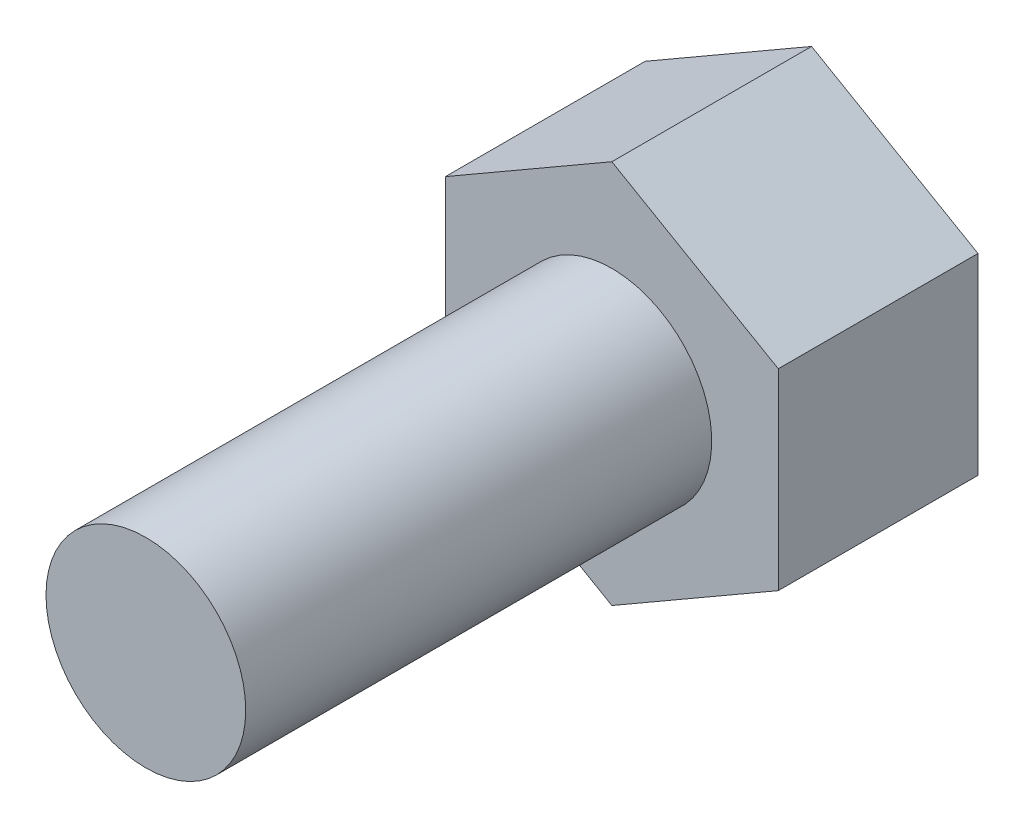
ISO-10303-21;
HEADER;
FILE_DESCRIPTION(('STEP AP214'),'2;1');
FILE_NAME('part.step','',(''),(''),'','','');
FILE_SCHEMA(('AUTOMOTIVE_DESIGN { 1 0 10303 214 1 1 1 1 }'));
ENDSEC;
DATA;
#1=APPLICATION_CONTEXT('core data for automotive mechanical design processes');
#2=APPLICATION_PROTOCOL_DEFINITION('international standard','automotive_design',2000,#1);
#3=PRODUCT_CONTEXT('',#1,'mechanical');
#4=PRODUCT('Part','Part','',(#3));
#5=PRODUCT_RELATED_PRODUCT_CATEGORY('part','',(#4));
#6=PRODUCT_DEFINITION_FORMATION('','',#4);
#7=PRODUCT_DEFINITION_CONTEXT('part definition',#1,'design');
#8=PRODUCT_DEFINITION('design','',#6,#7);
#9=PRODUCT_DEFINITION_SHAPE('','',#8);
#10=(LENGTH_UNIT() NAMED_UNIT(*) SI_UNIT(.MILLI.,.METRE.));
#11=(NAMED_UNIT(*) PLANE_ANGLE_UNIT() SI_UNIT($,.RADIAN.));
#12=(NAMED_UNIT(*) SI_UNIT($,.STERADIAN.) SOLID_ANGLE_UNIT());
#13=UNCERTAINTY_MEASURE_WITH_UNIT(LENGTH_MEASURE(1.E-05),#10,'distance_accuracy_value','');
#14=(GEOMETRIC_REPRESENTATION_CONTEXT(3) GLOBAL_UNCERTAINTY_ASSIGNED_CONTEXT((#13)) GLOBAL_UNIT_ASSIGNED_CONTEXT((#10,
#11,#12)) REPRESENTATION_CONTEXT('',''));
#15=CARTESIAN_POINT('',(0.,0.,0.));
#16=DIRECTION('',(0.,0.,1.));
#17=DIRECTION('',(1.,0.,0.));
#18=AXIS2_PLACEMENT_3D('',#15,#16,#17);
#19=CARTESIAN_POINT('',(-63.4947615904966,14.9787081339713,7.));
#20=DIRECTION('',(0.,0.,-1.));
#21=DIRECTION('',(-1.,0.,0.));
#22=AXIS2_PLACEMENT_3D('',#19,#20,#21);
#23=CYLINDRICAL_SURFACE('',#22,1.5);
#24=CARTESIAN_POINT('',(-63.4947615904966,14.9787081339713,7.));
#25=DIRECTION('',(0.,0.,1.));
#26=DIRECTION('',(1.,0.,0.));
#27=AXIS2_PLACEMENT_3D('',#24,#25,#26);
#28=CIRCLE('',#27,1.5);
#29=CARTESIAN_POINT('',(-61.9947615904966,14.9787081339713,7.));
#30=VERTEX_POINT('',#29);
#31=EDGE_CURVE('E11',#30,#30,#28,.T.);
#32=ORIENTED_EDGE('',*,*,#31,.F.);
#33=EDGE_LOOP('',(#32));
#34=FACE_BOUND('',#33,.T.);
#35=CARTESIAN_POINT('',(-63.4947615904966,14.9787081339713,0.));
#36=DIRECTION('',(0.,0.,-1.));
#37=DIRECTION('',(-1.,0.,0.));
#38=AXIS2_PLACEMENT_3D('',#35,#36,#37);
#39=CIRCLE('',#38,1.5);
#40=CARTESIAN_POINT('',(-64.9947615904966,14.9787081339713,0.));
#41=VERTEX_POINT('',#40);
#42=EDGE_CURVE('E41',#41,#41,#39,.T.);
#43=ORIENTED_EDGE('',*,*,#42,.F.);
#44=EDGE_LOOP('',(#43));
#45=FACE_BOUND('',#44,.T.);
#46=ADVANCED_FACE('F33',(#34,#45),#23,.T.);
#47=CARTESIAN_POINT('',(-63.4947615904966,14.9787081339713,7.));
#48=DIRECTION('',(0.,0.,1.));
#49=DIRECTION('',(1.,0.,0.));
#50=AXIS2_PLACEMENT_3D('',#47,#48,#49);
#51=PLANE('',#50);
#52=ORIENTED_EDGE('',*,*,#31,.T.);
#53=EDGE_LOOP('',(#52));
#54=FACE_BOUND('',#53,.T.);
#55=ADVANCED_FACE('F143',(#54),#51,.T.);
#56=CARTESIAN_POINT('',(-60.9947615904966,13.5353324609972,-3.));
#57=DIRECTION('',(-0.5,0.866025403784439,0.));
#58=DIRECTION('',(-0.866025403784439,-0.5,0.));
#59=AXIS2_PLACEMENT_3D('',#56,#57,#58);
#60=PLANE('',#59);
#61=DIRECTION('',(-0.866025403784439,-0.5,0.));
#62=VECTOR('',#61,1.);
#63=CARTESIAN_POINT('',(-60.9947615904966,13.5353324609972,0.));
#64=LINE('',#63,#62);
#65=CARTESIAN_POINT('',(-60.9947615904966,13.5353324609972,0.));
#66=VERTEX_POINT('',#65);
#67=CARTESIAN_POINT('',(-63.4947615904967,12.0919567880232,0.));
#68=VERTEX_POINT('',#67);
#69=EDGE_CURVE('E118',#66,#68,#64,.T.);
#70=ORIENTED_EDGE('',*,*,#69,.T.);
#71=DIRECTION('',(0.,0.,1.));
#72=VECTOR('',#71,1.);
#73=CARTESIAN_POINT('',(-63.4947615904967,12.0919567880232,-3.));
#74=LINE('',#73,#72);
#75=CARTESIAN_POINT('',(-63.4947615904967,12.0919567880232,-3.));
#76=VERTEX_POINT('',#75);
#77=EDGE_CURVE('E135',#76,#68,#74,.T.);
#78=ORIENTED_EDGE('',*,*,#77,.F.);
#79=DIRECTION('',(-0.866025403784439,-0.5,0.));
#80=VECTOR('',#79,1.);
#81=CARTESIAN_POINT('',(-60.9947615904966,13.5353324609972,-3.));
#82=LINE('',#81,#80);
#83=CARTESIAN_POINT('',(-60.9947615904966,13.5353324609972,-3.));
#84=VERTEX_POINT('',#83);
#85=EDGE_CURVE('E128',#84,#76,#82,.T.);
#86=ORIENTED_EDGE('',*,*,#85,.F.);
#87=DIRECTION('',(0.,0.,1.));
#88=VECTOR('',#87,1.);
#89=CARTESIAN_POINT('',(-60.9947615904966,13.5353324609972,-3.));
#90=LINE('',#89,#88);
#91=EDGE_CURVE('E114',#84,#66,#90,.T.);
#92=ORIENTED_EDGE('',*,*,#91,.T.);
#93=EDGE_LOOP('',(#70,#78,#86,#92));
#94=FACE_BOUND('',#93,.T.);
#95=ADVANCED_FACE('F148',(#94),#60,.F.);
#96=CARTESIAN_POINT('',(-63.4947615904967,12.0919567880232,-3.));
#97=DIRECTION('',(0.5,0.866025403784438,0.));
#98=DIRECTION('',(-0.866025403784438,0.5,0.));
#99=AXIS2_PLACEMENT_3D('',#96,#97,#98);
#100=PLANE('',#99);
#101=DIRECTION('',(-0.866025403784438,0.5,0.));
#102=VECTOR('',#101,1.);
#103=CARTESIAN_POINT('',(-63.4947615904967,12.0919567880232,0.));
#104=LINE('',#103,#102);
#105=CARTESIAN_POINT('',(-65.9947615904966,13.5353324609972,0.));
#106=VERTEX_POINT('',#105);
#107=EDGE_CURVE('E121',#68,#106,#104,.T.);
#108=ORIENTED_EDGE('',*,*,#107,.T.);
#109=DIRECTION('',(0.,0.,1.));
#110=VECTOR('',#109,1.);
#111=CARTESIAN_POINT('',(-65.9947615904966,13.5353324609972,-3.));
#112=LINE('',#111,#110);
#113=CARTESIAN_POINT('',(-65.9947615904966,13.5353324609972,-3.));
#114=VERTEX_POINT('',#113);
#115=EDGE_CURVE('E132',#114,#106,#112,.T.);
#116=ORIENTED_EDGE('',*,*,#115,.F.);
#117=DIRECTION('',(-0.866025403784438,0.5,0.));
#118=VECTOR('',#117,1.);
#119=CARTESIAN_POINT('',(-63.4947615904967,12.0919567880232,-3.));
#120=LINE('',#119,#118);
#121=EDGE_CURVE('E87',#76,#114,#120,.T.);
#122=ORIENTED_EDGE('',*,*,#121,.F.);
#123=ORIENTED_EDGE('',*,*,#77,.T.);
#124=EDGE_LOOP('',(#108,#116,#122,#123));
#125=FACE_BOUND('',#124,.T.);
#126=ADVANCED_FACE('F154',(#125),#100,.F.);
#127=CARTESIAN_POINT('',(-65.9947615904966,13.5353324609972,-3.));
#128=DIRECTION('',(1.,0.,0.));
#129=DIRECTION('',(0.,0.,-1.));
#130=AXIS2_PLACEMENT_3D('',#127,#128,#129);
#131=PLANE('',#130);
#132=DIRECTION('',(0.,1.,0.));
#133=VECTOR('',#132,1.);
#134=CARTESIAN_POINT('',(-65.9947615904966,13.5353324609972,0.));
#135=LINE('',#134,#133);
#136=CARTESIAN_POINT('',(-65.9947615904966,16.4220838069454,0.));
#137=VERTEX_POINT('',#136);
#138=EDGE_CURVE('E123',#106,#137,#135,.T.);
#139=ORIENTED_EDGE('',*,*,#138,.T.);
#140=DIRECTION('',(0.,0.,1.));
#141=VECTOR('',#140,1.);
#142=CARTESIAN_POINT('',(-65.9947615904966,16.4220838069454,-3.));
#143=LINE('',#142,#141);
#144=CARTESIAN_POINT('',(-65.9947615904966,16.4220838069454,-3.));
#145=VERTEX_POINT('',#144);
#146=EDGE_CURVE('E109',#145,#137,#143,.T.);
#147=ORIENTED_EDGE('',*,*,#146,.F.);
#148=DIRECTION('',(0.,1.,0.));
#149=VECTOR('',#148,1.);
#150=CARTESIAN_POINT('',(-65.9947615904966,13.5353324609972,-3.));
#151=LINE('',#150,#149);
#152=EDGE_CURVE('E100',#114,#145,#151,.T.);
#153=ORIENTED_EDGE('',*,*,#152,.F.);
#154=ORIENTED_EDGE('',*,*,#115,.T.);
#155=EDGE_LOOP('',(#139,#147,#153,#154));
#156=FACE_BOUND('',#155,.T.);
#157=ADVANCED_FACE('F160',(#156),#131,.F.);
#158=CARTESIAN_POINT('',(-65.9947615904966,16.4220838069454,-3.));
#159=DIRECTION('',(0.499999999999999,-0.866025403784439,0.));
#160=DIRECTION('',(0.866025403784439,0.499999999999999,0.));
#161=AXIS2_PLACEMENT_3D('',#158,#159,#160);
#162=PLANE('',#161);
#163=DIRECTION('',(0.866025403784439,0.499999999999999,0.));
#164=VECTOR('',#163,1.);
#165=CARTESIAN_POINT('',(-65.9947615904966,16.4220838069454,0.));
#166=LINE('',#165,#164);
#167=CARTESIAN_POINT('',(-63.4947615904966,17.8654594799194,0.));
#168=VERTEX_POINT('',#167);
#169=EDGE_CURVE('E108',#137,#168,#166,.T.);
#170=ORIENTED_EDGE('',*,*,#169,.T.);
#171=DIRECTION('',(0.,0.,1.));
#172=VECTOR('',#171,1.);
#173=CARTESIAN_POINT('',(-63.4947615904966,17.8654594799194,-3.));
#174=LINE('',#173,#172);
#175=CARTESIAN_POINT('',(-63.4947615904966,17.8654594799194,-3.));
#176=VERTEX_POINT('',#175);
#177=EDGE_CURVE('E105',#176,#168,#174,.T.);
#178=ORIENTED_EDGE('',*,*,#177,.F.);
#179=DIRECTION('',(0.866025403784439,0.499999999999999,0.));
#180=VECTOR('',#179,1.);
#181=CARTESIAN_POINT('',(-65.9947615904966,16.4220838069454,-3.));
#182=LINE('',#181,#180);
#183=EDGE_CURVE('E94',#145,#176,#182,.T.);
#184=ORIENTED_EDGE('',*,*,#183,.F.);
#185=ORIENTED_EDGE('',*,*,#146,.T.);
#186=EDGE_LOOP('',(#170,#178,#184,#185));
#187=FACE_BOUND('',#186,.T.);
#188=ADVANCED_FACE('F106',(#187),#162,.F.);
#189=CARTESIAN_POINT('',(-63.4947615904966,17.8654594799194,-3.));
#190=DIRECTION('',(-0.500000000000001,-0.866025403784438,0.));
#191=DIRECTION('',(0.866025403784438,-0.500000000000001,0.));
#192=AXIS2_PLACEMENT_3D('',#189,#190,#191);
#193=PLANE('',#192);
#194=DIRECTION('',(0.866025403784438,-0.500000000000001,0.));
#195=VECTOR('',#194,1.);
#196=CARTESIAN_POINT('',(-63.4947615904966,17.8654594799194,0.));
#197=LINE('',#196,#195);
#198=CARTESIAN_POINT('',(-60.9947615904966,16.4220838069454,0.));
#199=VERTEX_POINT('',#198);
#200=EDGE_CURVE('E72',#168,#199,#197,.T.);
#201=ORIENTED_EDGE('',*,*,#200,.T.);
#202=DIRECTION('',(0.,0.,1.));
#203=VECTOR('',#202,1.);
#204=CARTESIAN_POINT('',(-60.9947615904966,16.4220838069454,-3.));
#205=LINE('',#204,#203);
#206=CARTESIAN_POINT('',(-60.9947615904966,16.4220838069454,-3.));
#207=VERTEX_POINT('',#206);
#208=EDGE_CURVE('E110',#207,#199,#205,.T.);
#209=ORIENTED_EDGE('',*,*,#208,.F.);
#210=DIRECTION('',(0.866025403784438,-0.500000000000001,0.));
#211=VECTOR('',#210,1.);
#212=CARTESIAN_POINT('',(-63.4947615904966,17.8654594799194,-3.));
#213=LINE('',#212,#211);
#214=EDGE_CURVE('E98',#176,#207,#213,.T.);
#215=ORIENTED_EDGE('',*,*,#214,.F.);
#216=ORIENTED_EDGE('',*,*,#177,.T.);
#217=EDGE_LOOP('',(#201,#209,#215,#216));
#218=FACE_BOUND('',#217,.T.);
#219=ADVANCED_FACE('F112',(#218),#193,.F.);
#220=CARTESIAN_POINT('',(-60.9947615904966,16.4220838069454,-3.));
#221=DIRECTION('',(-1.,0.,0.));
#222=DIRECTION('',(0.,0.,1.));
#223=AXIS2_PLACEMENT_3D('',#220,#221,#222);
#224=PLANE('',#223);
#225=DIRECTION('',(0.,-1.,0.));
#226=VECTOR('',#225,1.);
#227=CARTESIAN_POINT('',(-60.9947615904966,16.4220838069454,0.));
#228=LINE('',#227,#226);
#229=EDGE_CURVE('E78',#199,#66,#228,.T.);
#230=ORIENTED_EDGE('',*,*,#229,.T.);
#231=ORIENTED_EDGE('',*,*,#91,.F.);
#232=DIRECTION('',(0.,-1.,0.));
#233=VECTOR('',#232,1.);
#234=CARTESIAN_POINT('',(-60.9947615904966,16.4220838069454,-3.));
#235=LINE('',#234,#233);
#236=EDGE_CURVE('E49',#207,#84,#235,.T.);
#237=ORIENTED_EDGE('',*,*,#236,.F.);
#238=ORIENTED_EDGE('',*,*,#208,.T.);
#239=EDGE_LOOP('',(#230,#231,#237,#238));
#240=FACE_BOUND('',#239,.T.);
#241=ADVANCED_FACE('F168',(#240),#224,.F.);
#242=CARTESIAN_POINT('',(0.,0.,-3.));
#243=DIRECTION('',(0.,0.,-1.));
#244=DIRECTION('',(-1.,0.,0.));
#245=AXIS2_PLACEMENT_3D('',#242,#243,#244);
#246=PLANE('',#245);
#247=ORIENTED_EDGE('',*,*,#85,.T.);
#248=ORIENTED_EDGE('',*,*,#121,.T.);
#249=ORIENTED_EDGE('',*,*,#152,.T.);
#250=ORIENTED_EDGE('',*,*,#183,.T.);
#251=ORIENTED_EDGE('',*,*,#214,.T.);
#252=ORIENTED_EDGE('',*,*,#236,.T.);
#253=EDGE_LOOP('',(#247,#248,#249,#250,#251,#252));
#254=FACE_BOUND('',#253,.T.);
#255=ADVANCED_FACE('F96',(#254),#246,.T.);
#256=CARTESIAN_POINT('',(0.,0.,0.));
#257=DIRECTION('',(0.,0.,-1.));
#258=DIRECTION('',(-1.,0.,0.));
#259=AXIS2_PLACEMENT_3D('',#256,#257,#258);
#260=PLANE('',#259);
#261=ORIENTED_EDGE('',*,*,#42,.T.);
#262=EDGE_LOOP('',(#261));
#263=FACE_BOUND('',#262,.T.);
#264=ORIENTED_EDGE('',*,*,#69,.F.);
#265=ORIENTED_EDGE('',*,*,#229,.F.);
#266=ORIENTED_EDGE('',*,*,#200,.F.);
#267=ORIENTED_EDGE('',*,*,#169,.F.);
#268=ORIENTED_EDGE('',*,*,#138,.F.);
#269=ORIENTED_EDGE('',*,*,#107,.F.);
#270=EDGE_LOOP('',(#264,#265,#266,#267,#268,#269));
#271=FACE_BOUND('',#270,.T.);
#272=ADVANCED_FACE('F139',(#263,#271),#260,.F.);
#273=CLOSED_SHELL('',(#46,#55,#95,#126,#157,#188,#219,#241,#255,#272));
#274=MANIFOLD_SOLID_BREP('B2',#273);
#275=ADVANCED_BREP_SHAPE_REPRESENTATION('',(#18,#274),#14);
#276=SHAPE_DEFINITION_REPRESENTATION(#9,#275);
ENDSEC;
END-ISO-10303-21;
